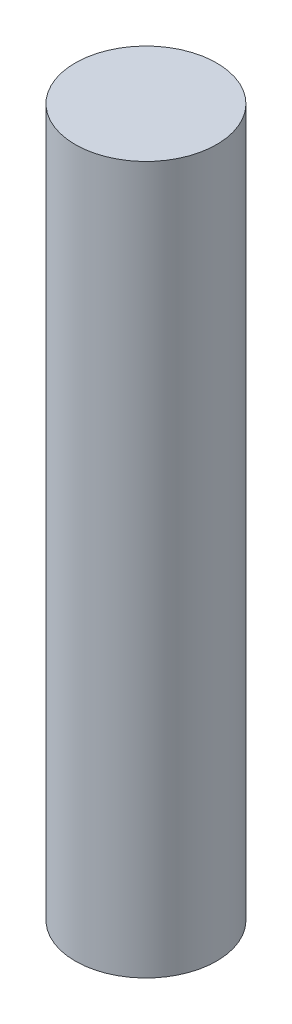
ISO-10303-21;
HEADER;
FILE_DESCRIPTION(('STEP AP214'),'2;1');
FILE_NAME('part.step','',(''),(''),'','','');
FILE_SCHEMA(('AUTOMOTIVE_DESIGN { 1 0 10303 214 1 1 1 1 }'));
ENDSEC;
DATA;
#1=APPLICATION_CONTEXT('core data for automotive mechanical design processes');
#2=APPLICATION_PROTOCOL_DEFINITION('international standard','automotive_design',2000,#1);
#3=PRODUCT_CONTEXT('',#1,'mechanical');
#4=PRODUCT('Part','Part','',(#3));
#5=PRODUCT_RELATED_PRODUCT_CATEGORY('part','',(#4));
#6=PRODUCT_DEFINITION_FORMATION('','',#4);
#7=PRODUCT_DEFINITION_CONTEXT('part definition',#1,'design');
#8=PRODUCT_DEFINITION('design','',#6,#7);
#9=PRODUCT_DEFINITION_SHAPE('','',#8);
#10=(LENGTH_UNIT() NAMED_UNIT(*) SI_UNIT(.MILLI.,.METRE.));
#11=(NAMED_UNIT(*) PLANE_ANGLE_UNIT() SI_UNIT($,.RADIAN.));
#12=(NAMED_UNIT(*) SI_UNIT($,.STERADIAN.) SOLID_ANGLE_UNIT());
#13=UNCERTAINTY_MEASURE_WITH_UNIT(LENGTH_MEASURE(1.E-05),#10,'distance_accuracy_value','');
#14=(GEOMETRIC_REPRESENTATION_CONTEXT(3) GLOBAL_UNCERTAINTY_ASSIGNED_CONTEXT((#13)) GLOBAL_UNIT_ASSIGNED_CONTEXT((#10,
#11,#12)) REPRESENTATION_CONTEXT('',''));
#15=CARTESIAN_POINT('',(0.,0.,0.));
#16=DIRECTION('',(0.,0.,1.));
#17=DIRECTION('',(1.,0.,0.));
#18=AXIS2_PLACEMENT_3D('',#15,#16,#17);
#19=CARTESIAN_POINT('',(0.,450.,0.));
#20=DIRECTION('',(0.,-1.,0.));
#21=DIRECTION('',(0.,0.,-1.));
#22=AXIS2_PLACEMENT_3D('',#19,#20,#21);
#23=CYLINDRICAL_SURFACE('',#22,45.);
#24=CARTESIAN_POINT('',(0.,450.,0.));
#25=DIRECTION('',(0.,1.,0.));
#26=DIRECTION('',(0.,0.,1.));
#27=AXIS2_PLACEMENT_3D('',#24,#25,#26);
#28=CIRCLE('',#27,45.);
#29=CARTESIAN_POINT('',(0.,450.,45.));
#30=VERTEX_POINT('',#29);
#31=EDGE_CURVE('E10',#30,#30,#28,.T.);
#32=ORIENTED_EDGE('',*,*,#31,.F.);
#33=EDGE_LOOP('',(#32));
#34=FACE_BOUND('',#33,.T.);
#35=CARTESIAN_POINT('',(0.,0.,0.));
#36=DIRECTION('',(0.,1.,0.));
#37=DIRECTION('',(0.,0.,1.));
#38=AXIS2_PLACEMENT_3D('',#35,#36,#37);
#39=CIRCLE('',#38,45.);
#40=CARTESIAN_POINT('',(0.,0.,45.));
#41=VERTEX_POINT('',#40);
#42=EDGE_CURVE('E38',#41,#41,#39,.T.);
#43=ORIENTED_EDGE('',*,*,#42,.T.);
#44=EDGE_LOOP('',(#43));
#45=FACE_BOUND('',#44,.T.);
#46=ADVANCED_FACE('F35',(#34,#45),#23,.T.);
#47=CARTESIAN_POINT('',(0.,450.,0.));
#48=DIRECTION('',(0.,1.,0.));
#49=DIRECTION('',(0.,0.,1.));
#50=AXIS2_PLACEMENT_3D('',#47,#48,#49);
#51=PLANE('',#50);
#52=ORIENTED_EDGE('',*,*,#31,.T.);
#53=EDGE_LOOP('',(#52));
#54=FACE_BOUND('',#53,.T.);
#55=ADVANCED_FACE('F50',(#54),#51,.T.);
#56=CARTESIAN_POINT('',(0.,0.,0.));
#57=DIRECTION('',(0.,1.,0.));
#58=DIRECTION('',(0.,0.,1.));
#59=AXIS2_PLACEMENT_3D('',#56,#57,#58);
#60=PLANE('',#59);
#61=ORIENTED_EDGE('',*,*,#42,.F.);
#62=EDGE_LOOP('',(#61));
#63=FACE_BOUND('',#62,.T.);
#64=ADVANCED_FACE('F48',(#63),#60,.F.);
#65=CLOSED_SHELL('',(#46,#55,#64));
#66=MANIFOLD_SOLID_BREP('B2',#65);
#67=ADVANCED_BREP_SHAPE_REPRESENTATION('',(#18,#66),#14);
#68=SHAPE_DEFINITION_REPRESENTATION(#9,#67);
ENDSEC;
END-ISO-10303-21;
